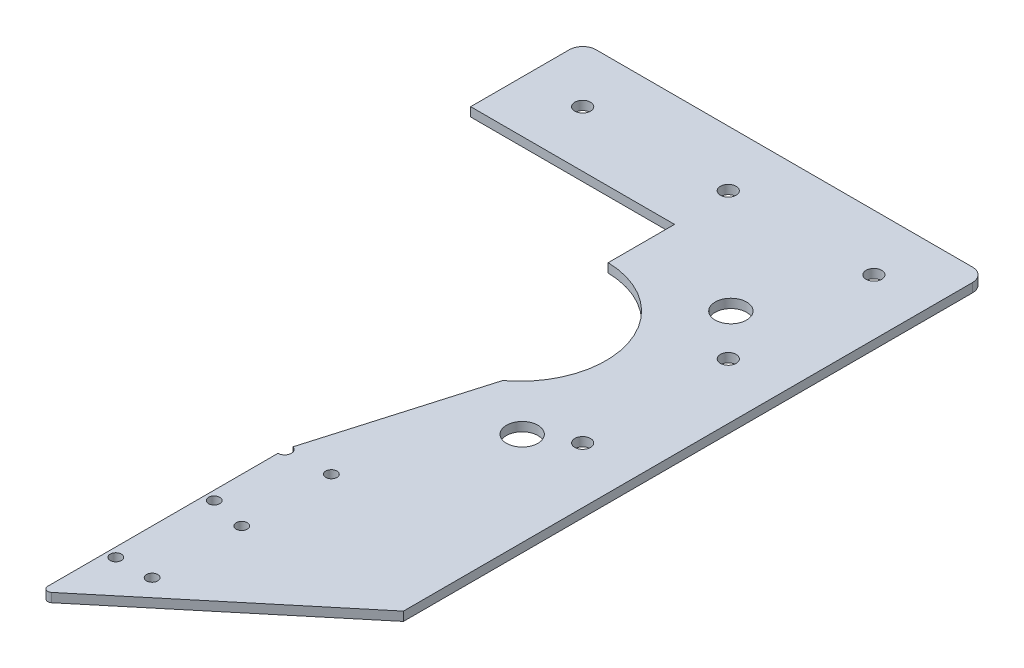
ISO-10303-21;
HEADER;
FILE_DESCRIPTION(('STEP AP214'),'2;1');
FILE_NAME('part.step','',(''),(''),'','','');
FILE_SCHEMA(('AUTOMOTIVE_DESIGN { 1 0 10303 214 1 1 1 1 }'));
ENDSEC;
DATA;
#1=APPLICATION_CONTEXT('core data for automotive mechanical design processes');
#2=APPLICATION_PROTOCOL_DEFINITION('international standard','automotive_design',2000,#1);
#3=PRODUCT_CONTEXT('',#1,'mechanical');
#4=PRODUCT('Part','Part','',(#3));
#5=PRODUCT_RELATED_PRODUCT_CATEGORY('part','',(#4));
#6=PRODUCT_DEFINITION_FORMATION('','',#4);
#7=PRODUCT_DEFINITION_CONTEXT('part definition',#1,'design');
#8=PRODUCT_DEFINITION('design','',#6,#7);
#9=PRODUCT_DEFINITION_SHAPE('','',#8);
#10=(LENGTH_UNIT() NAMED_UNIT(*) SI_UNIT(.MILLI.,.METRE.));
#11=(NAMED_UNIT(*) PLANE_ANGLE_UNIT() SI_UNIT($,.RADIAN.));
#12=(NAMED_UNIT(*) SI_UNIT($,.STERADIAN.) SOLID_ANGLE_UNIT());
#13=UNCERTAINTY_MEASURE_WITH_UNIT(LENGTH_MEASURE(1.E-05),#10,'distance_accuracy_value','');
#14=(GEOMETRIC_REPRESENTATION_CONTEXT(3) GLOBAL_UNCERTAINTY_ASSIGNED_CONTEXT((#13)) GLOBAL_UNIT_ASSIGNED_CONTEXT((#10,
#11,#12)) REPRESENTATION_CONTEXT('',''));
#15=CARTESIAN_POINT('',(0.,0.,0.));
#16=DIRECTION('',(0.,0.,1.));
#17=DIRECTION('',(1.,0.,0.));
#18=AXIS2_PLACEMENT_3D('',#15,#16,#17);
#19=CARTESIAN_POINT('',(-11.5454283324964,2.,55.8050847457628));
#20=DIRECTION('',(1.,0.,0.));
#21=DIRECTION('',(0.,0.,-1.));
#22=AXIS2_PLACEMENT_3D('',#19,#20,#21);
#23=PLANE('',#22);
#24=DIRECTION('',(0.,0.,1.));
#25=VECTOR('',#24,1.);
#26=CARTESIAN_POINT('',(-11.5454283324964,0.,55.8050847457628));
#27=LINE('',#26,#25);
#28=CARTESIAN_POINT('',(-11.5454283324964,0.,-9.19491525423725));
#29=VERTEX_POINT('',#28);
#30=CARTESIAN_POINT('',(-11.5454283324964,0.,5.61159626659359));
#31=VERTEX_POINT('',#30);
#32=EDGE_CURVE('E153',#29,#31,#27,.T.);
#33=ORIENTED_EDGE('',*,*,#32,.T.);
#34=DIRECTION('',(0.,1.,0.));
#35=VECTOR('',#34,1.);
#36=CARTESIAN_POINT('',(-11.5454283324964,0.,5.61159626659359));
#37=LINE('',#36,#35);
#38=CARTESIAN_POINT('',(-11.5454283324964,2.,5.61159626659359));
#39=VERTEX_POINT('',#38);
#40=EDGE_CURVE('E178',#31,#39,#37,.T.);
#41=ORIENTED_EDGE('',*,*,#40,.T.);
#42=DIRECTION('',(0.,0.,1.));
#43=VECTOR('',#42,1.);
#44=CARTESIAN_POINT('',(-11.5454283324964,2.,55.8050847457628));
#45=LINE('',#44,#43);
#46=CARTESIAN_POINT('',(-11.5454283324964,2.,-9.19491525423725));
#47=VERTEX_POINT('',#46);
#48=EDGE_CURVE('E266',#47,#39,#45,.T.);
#49=ORIENTED_EDGE('',*,*,#48,.F.);
#50=DIRECTION('',(0.,1.,0.));
#51=VECTOR('',#50,1.);
#52=CARTESIAN_POINT('',(-11.5454283324964,-71.175838597097,-9.19491525423725));
#53=LINE('',#52,#51);
#54=EDGE_CURVE('E211',#29,#47,#53,.T.);
#55=ORIENTED_EDGE('',*,*,#54,.F.);
#56=EDGE_LOOP('',(#33,#41,#49,#55));
#57=FACE_BOUND('',#56,.T.);
#58=ADVANCED_FACE('F40',(#57),#23,.F.);
#59=CARTESIAN_POINT('',(-57.0454283324964,2.,-9.19491525423725));
#60=DIRECTION('',(0.,0.,-1.));
#61=DIRECTION('',(-1.,0.,0.));
#62=AXIS2_PLACEMENT_3D('',#59,#60,#61);
#63=PLANE('',#62);
#64=ORIENTED_EDGE('',*,*,#54,.T.);
#65=DIRECTION('',(1.,0.,0.));
#66=VECTOR('',#65,1.);
#67=CARTESIAN_POINT('',(-57.0454283324964,2.,-9.19491525423725));
#68=LINE('',#67,#66);
#69=CARTESIAN_POINT('',(-57.0454283324964,2.,-9.19491525423725));
#70=VERTEX_POINT('',#69);
#71=EDGE_CURVE('E258',#70,#47,#68,.T.);
#72=ORIENTED_EDGE('',*,*,#71,.F.);
#73=DIRECTION('',(0.,-1.,0.));
#74=VECTOR('',#73,1.);
#75=CARTESIAN_POINT('',(-57.0454283324964,2.,-9.19491525423725));
#76=LINE('',#75,#74);
#77=CARTESIAN_POINT('',(-57.0454283324964,0.,-9.19491525423725));
#78=VERTEX_POINT('',#77);
#79=EDGE_CURVE('E174',#70,#78,#76,.T.);
#80=ORIENTED_EDGE('',*,*,#79,.T.);
#81=DIRECTION('',(1.,0.,0.));
#82=VECTOR('',#81,1.);
#83=CARTESIAN_POINT('',(-57.0454283324964,0.,-9.19491525423725));
#84=LINE('',#83,#82);
#85=EDGE_CURVE('E154',#78,#29,#84,.T.);
#86=ORIENTED_EDGE('',*,*,#85,.T.);
#87=EDGE_LOOP('',(#64,#72,#80,#86));
#88=FACE_BOUND('',#87,.T.);
#89=ADVANCED_FACE('F300',(#88),#63,.F.);
#90=CARTESIAN_POINT('',(0.,2.,0.));
#91=DIRECTION('',(0.,1.,0.));
#92=DIRECTION('',(0.,0.,1.));
#93=AXIS2_PLACEMENT_3D('',#90,#91,#92);
#94=PLANE('',#93);
#95=CARTESIAN_POINT('',(-1.54542833249639,2.,97.398618321744));
#96=DIRECTION('',(0.,1.,0.));
#97=DIRECTION('',(0.,0.,1.));
#98=AXIS2_PLACEMENT_3D('',#95,#96,#97);
#99=CIRCLE('',#98,1.25);
#100=CARTESIAN_POINT('',(-1.54542833249639,2.,98.648618321744));
#101=VERTEX_POINT('',#100);
#102=EDGE_CURVE('E563',#101,#101,#99,.T.);
#103=ORIENTED_EDGE('',*,*,#102,.F.);
#104=EDGE_LOOP('',(#103));
#105=FACE_BOUND('',#104,.T.);
#106=CARTESIAN_POINT('',(-1.54542833249639,2.,77.398618321744));
#107=DIRECTION('',(0.,1.,0.));
#108=DIRECTION('',(0.,0.,1.));
#109=AXIS2_PLACEMENT_3D('',#106,#107,#108);
#110=CIRCLE('',#109,1.25);
#111=CARTESIAN_POINT('',(-1.54542833249639,2.,78.648618321744));
#112=VERTEX_POINT('',#111);
#113=EDGE_CURVE('E566',#112,#112,#110,.T.);
#114=ORIENTED_EDGE('',*,*,#113,.F.);
#115=EDGE_LOOP('',(#114));
#116=FACE_BOUND('',#115,.T.);
#117=CARTESIAN_POINT('',(-1.54542833249639,2.,117.398618321744));
#118=DIRECTION('',(0.,1.,0.));
#119=DIRECTION('',(0.,0.,1.));
#120=AXIS2_PLACEMENT_3D('',#117,#118,#119);
#121=CIRCLE('',#120,1.25);
#122=CARTESIAN_POINT('',(-1.54542833249639,2.,118.648618321744));
#123=VERTEX_POINT('',#122);
#124=EDGE_CURVE('E582',#123,#123,#121,.T.);
#125=ORIENTED_EDGE('',*,*,#124,.F.);
#126=EDGE_LOOP('',(#125));
#127=FACE_BOUND('',#126,.T.);
#128=CARTESIAN_POINT('',(-9.54492595992691,2.,117.508337258848));
#129=DIRECTION('',(0.,1.,0.));
#130=DIRECTION('',(0.,0.,1.));
#131=AXIS2_PLACEMENT_3D('',#128,#129,#130);
#132=CIRCLE('',#131,1.25);
#133=CARTESIAN_POINT('',(-9.54492595992691,2.,118.758337258848));
#134=VERTEX_POINT('',#133);
#135=EDGE_CURVE('E589',#134,#134,#132,.T.);
#136=ORIENTED_EDGE('',*,*,#135,.F.);
#137=EDGE_LOOP('',(#136));
#138=FACE_BOUND('',#137,.T.);
#139=CARTESIAN_POINT('',(-9.54492595992691,2.,95.5512256416138));
#140=DIRECTION('',(0.,1.,0.));
#141=DIRECTION('',(0.,0.,1.));
#142=AXIS2_PLACEMENT_3D('',#139,#140,#141);
#143=CIRCLE('',#142,1.25);
#144=CARTESIAN_POINT('',(-9.54492595992691,2.,96.8012256416138));
#145=VERTEX_POINT('',#144);
#146=EDGE_CURVE('E144',#145,#145,#143,.T.);
#147=ORIENTED_EDGE('',*,*,#146,.F.);
#148=EDGE_LOOP('',(#147));
#149=FACE_BOUND('',#148,.T.);
#150=CARTESIAN_POINT('',(-11.5454283324964,2.,79.3092614399867));
#151=VERTEX_POINT('',#150);
#152=CARTESIAN_POINT('',(-11.5454283324964,2.,130.673113843783));
#153=VERTEX_POINT('',#152);
#154=EDGE_CURVE('E148',#151,#153,#45,.T.);
#155=ORIENTED_EDGE('',*,*,#154,.T.);
#156=CARTESIAN_POINT('',(-10.5454283324964,2.,130.673113843783));
#157=DIRECTION('',(0.,1.,0.));
#158=DIRECTION('',(0.,0.,1.));
#159=AXIS2_PLACEMENT_3D('',#156,#157,#158);
#160=CIRCLE('',#159,1.);
#161=CARTESIAN_POINT('',(-9.90609412629823,2.,131.442042821508));
#162=VERTEX_POINT('',#161);
#163=EDGE_CURVE('E12',#153,#162,#160,.T.);
#164=ORIENTED_EDGE('',*,*,#163,.T.);
#165=DIRECTION('',(0.76892897772483,0.,-0.639334206198173));
#166=VECTOR('',#165,1.);
#167=CARTESIAN_POINT('',(-11.5454283324964,2.,132.805084745763));
#168=LINE('',#167,#166);
#169=CARTESIAN_POINT('',(32.9545716675036,2.,95.8050847457628));
#170=VERTEX_POINT('',#169);
#171=EDGE_CURVE('E270',#162,#170,#168,.T.);
#172=ORIENTED_EDGE('',*,*,#171,.T.);
#173=DIRECTION('',(0.,0.,-1.));
#174=VECTOR('',#173,1.);
#175=CARTESIAN_POINT('',(32.9545716675036,2.,-34.1949152542373));
#176=LINE('',#175,#174);
#177=CARTESIAN_POINT('',(32.9545716675036,2.,-31.1949152542372));
#178=VERTEX_POINT('',#177);
#179=EDGE_CURVE('E282',#170,#178,#176,.T.);
#180=ORIENTED_EDGE('',*,*,#179,.T.);
#181=CARTESIAN_POINT('',(29.9545716675036,2.,-31.1949152542372));
#182=DIRECTION('',(0.,1.,0.));
#183=DIRECTION('',(0.,0.,1.));
#184=AXIS2_PLACEMENT_3D('',#181,#182,#183);
#185=CIRCLE('',#184,3.);
#186=CARTESIAN_POINT('',(29.9545716675035,2.,-34.1949152542373));
#187=VERTEX_POINT('',#186);
#188=EDGE_CURVE('E320',#178,#187,#185,.T.);
#189=ORIENTED_EDGE('',*,*,#188,.T.);
#190=DIRECTION('',(-1.,0.,0.));
#191=VECTOR('',#190,1.);
#192=CARTESIAN_POINT('',(-57.0454283324964,2.,-34.1949152542373));
#193=LINE('',#192,#191);
#194=CARTESIAN_POINT('',(-54.0454283324964,2.,-34.1949152542373));
#195=VERTEX_POINT('',#194);
#196=EDGE_CURVE('E175',#187,#195,#193,.T.);
#197=ORIENTED_EDGE('',*,*,#196,.T.);
#198=CARTESIAN_POINT('',(-54.0454283324964,2.,-31.1949152542372));
#199=DIRECTION('',(0.,1.,0.));
#200=DIRECTION('',(0.,0.,1.));
#201=AXIS2_PLACEMENT_3D('',#198,#199,#200);
#202=CIRCLE('',#201,3.);
#203=CARTESIAN_POINT('',(-57.0454283324964,2.,-31.1949152542372));
#204=VERTEX_POINT('',#203);
#205=EDGE_CURVE('E318',#195,#204,#202,.T.);
#206=ORIENTED_EDGE('',*,*,#205,.T.);
#207=DIRECTION('',(0.,0.,1.));
#208=VECTOR('',#207,1.);
#209=CARTESIAN_POINT('',(-57.0454283324964,2.,-34.1949152542373));
#210=LINE('',#209,#208);
#211=EDGE_CURVE('E170',#204,#70,#210,.T.);
#212=ORIENTED_EDGE('',*,*,#211,.T.);
#213=ORIENTED_EDGE('',*,*,#71,.T.);
#214=ORIENTED_EDGE('',*,*,#48,.T.);
#215=CARTESIAN_POINT('',(-12.0454283324964,2.,24.8050847457628));
#216=DIRECTION('',(0.,1.,0.));
#217=DIRECTION('',(0.,0.,1.));
#218=AXIS2_PLACEMENT_3D('',#215,#216,#217);
#219=CIRCLE('',#218,19.2);
#220=CARTESIAN_POINT('',(-0.545428332496404,2.,40.1800644205461));
#221=VERTEX_POINT('',#220);
#222=EDGE_CURVE('E203',#221,#39,#219,.T.);
#223=ORIENTED_EDGE('',*,*,#222,.F.);
#224=DIRECTION('',(0.280583353559269,0.,-0.959829662859736));
#225=VECTOR('',#224,1.);
#226=CARTESIAN_POINT('',(-0.545428332496404,2.,40.1800644205461));
#227=LINE('',#226,#225);
#228=CARTESIAN_POINT('',(-11.1245533021575,2.,76.3695169456971));
#229=VERTEX_POINT('',#228);
#230=EDGE_CURVE('E182',#229,#221,#227,.T.);
#231=ORIENTED_EDGE('',*,*,#230,.F.);
#232=CARTESIAN_POINT('',(-11.5454283324964,2.,77.8092614399867));
#233=DIRECTION('',(0.,1.,0.));
#234=DIRECTION('',(0.,0.,1.));
#235=AXIS2_PLACEMENT_3D('',#232,#233,#234);
#236=CIRCLE('',#235,1.5);
#237=EDGE_CURVE('E143',#151,#229,#236,.T.);
#238=ORIENTED_EDGE('',*,*,#237,.F.);
#239=EDGE_LOOP('',(#155,#164,#172,#180,#189,#197,#206,#212,#213,#214,#223,#231,#238));
#240=FACE_BOUND('',#239,.T.);
#241=CARTESIAN_POINT('',(20.4545716675036,2.,-21.6949152542372));
#242=DIRECTION('',(0.,1.,0.));
#243=DIRECTION('',(0.,0.,1.));
#244=AXIS2_PLACEMENT_3D('',#241,#242,#243);
#245=CIRCLE('',#244,1.74999999999999);
#246=CARTESIAN_POINT('',(20.4545716675036,2.,-19.9449152542373));
#247=VERTEX_POINT('',#246);
#248=EDGE_CURVE('E231',#247,#247,#245,.T.);
#249=ORIENTED_EDGE('',*,*,#248,.F.);
#250=EDGE_LOOP('',(#249));
#251=FACE_BOUND('',#250,.T.);
#252=CARTESIAN_POINT('',(-12.0454283324964,2.,-21.6949152542372));
#253=DIRECTION('',(0.,1.,0.));
#254=DIRECTION('',(0.,0.,1.));
#255=AXIS2_PLACEMENT_3D('',#252,#253,#254);
#256=CIRCLE('',#255,1.75);
#257=CARTESIAN_POINT('',(-12.0454283324964,2.,-19.9449152542372));
#258=VERTEX_POINT('',#257);
#259=EDGE_CURVE('E244',#258,#258,#256,.T.);
#260=ORIENTED_EDGE('',*,*,#259,.F.);
#261=EDGE_LOOP('',(#260));
#262=FACE_BOUND('',#261,.T.);
#263=CARTESIAN_POINT('',(-44.5454283324964,2.,-21.6949152542373));
#264=DIRECTION('',(0.,1.,0.));
#265=DIRECTION('',(0.,0.,1.));
#266=AXIS2_PLACEMENT_3D('',#263,#264,#265);
#267=CIRCLE('',#266,1.75);
#268=CARTESIAN_POINT('',(-44.5454283324964,2.,-19.9449152542372));
#269=VERTEX_POINT('',#268);
#270=EDGE_CURVE('E250',#269,#269,#267,.T.);
#271=ORIENTED_EDGE('',*,*,#270,.F.);
#272=EDGE_LOOP('',(#271));
#273=FACE_BOUND('',#272,.T.);
#274=CARTESIAN_POINT('',(20.4545716675036,2.,10.8050847457628));
#275=DIRECTION('',(0.,1.,0.));
#276=DIRECTION('',(0.,0.,1.));
#277=AXIS2_PLACEMENT_3D('',#274,#275,#276);
#278=CIRCLE('',#277,1.75);
#279=CARTESIAN_POINT('',(20.4545716675036,2.,12.5550847457628));
#280=VERTEX_POINT('',#279);
#281=EDGE_CURVE('E237',#280,#280,#278,.T.);
#282=ORIENTED_EDGE('',*,*,#281,.F.);
#283=EDGE_LOOP('',(#282));
#284=FACE_BOUND('',#283,.T.);
#285=CARTESIAN_POINT('',(20.4545716675036,2.,43.3050847457627));
#286=DIRECTION('',(0.,1.,0.));
#287=DIRECTION('',(0.,0.,1.));
#288=AXIS2_PLACEMENT_3D('',#285,#286,#287);
#289=CIRCLE('',#288,1.75);
#290=CARTESIAN_POINT('',(20.4545716675036,2.,45.0550847457628));
#291=VERTEX_POINT('',#290);
#292=EDGE_CURVE('E225',#291,#291,#289,.T.);
#293=ORIENTED_EDGE('',*,*,#292,.F.);
#294=EDGE_LOOP('',(#293));
#295=FACE_BOUND('',#294,.T.);
#296=CARTESIAN_POINT('',(11.4931539006409,2.,1.26650251262484));
#297=DIRECTION('',(0.,1.,0.));
#298=DIRECTION('',(0.,0.,1.));
#299=AXIS2_PLACEMENT_3D('',#296,#297,#298);
#300=CIRCLE('',#299,3.5);
#301=CARTESIAN_POINT('',(11.4931539006409,2.,4.76650251262484));
#302=VERTEX_POINT('',#301);
#303=EDGE_CURVE('E206',#302,#302,#300,.T.);
#304=ORIENTED_EDGE('',*,*,#303,.F.);
#305=EDGE_LOOP('',(#304));
#306=FACE_BOUND('',#305,.T.);
#307=CARTESIAN_POINT('',(12.0271004853378,2.,48.3750847457627));
#308=DIRECTION('',(0.,1.,0.));
#309=DIRECTION('',(0.,0.,1.));
#310=AXIS2_PLACEMENT_3D('',#307,#308,#309);
#311=CIRCLE('',#310,3.5);
#312=CARTESIAN_POINT('',(12.0271004853378,2.,51.8750847457627));
#313=VERTEX_POINT('',#312);
#314=EDGE_CURVE('E217',#313,#313,#311,.T.);
#315=ORIENTED_EDGE('',*,*,#314,.F.);
#316=EDGE_LOOP('',(#315));
#317=FACE_BOUND('',#316,.T.);
#318=ADVANCED_FACE('F304',(#105,#116,#127,#138,#149,#240,#251,#262,#273,#284,#295,#306,#317),
#94,.T.);
#319=CARTESIAN_POINT('',(0.,0.,0.));
#320=DIRECTION('',(0.,1.,0.));
#321=DIRECTION('',(0.,0.,1.));
#322=AXIS2_PLACEMENT_3D('',#319,#320,#321);
#323=PLANE('',#322);
#324=CARTESIAN_POINT('',(-1.54542833249639,0.,97.398618321744));
#325=DIRECTION('',(0.,1.,0.));
#326=DIRECTION('',(0.,0.,-1.));
#327=AXIS2_PLACEMENT_3D('',#324,#325,#326);
#328=CIRCLE('',#327,1.25);
#329=CARTESIAN_POINT('',(-1.54542833249639,0.,96.148618321744));
#330=VERTEX_POINT('',#329);
#331=EDGE_CURVE('E565',#330,#330,#328,.T.);
#332=ORIENTED_EDGE('',*,*,#331,.T.);
#333=EDGE_LOOP('',(#332));
#334=FACE_BOUND('',#333,.T.);
#335=CARTESIAN_POINT('',(-1.54542833249639,0.,77.398618321744));
#336=DIRECTION('',(0.,1.,0.));
#337=DIRECTION('',(0.,0.,-1.));
#338=AXIS2_PLACEMENT_3D('',#335,#336,#337);
#339=CIRCLE('',#338,1.25);
#340=CARTESIAN_POINT('',(-1.54542833249639,0.,76.148618321744));
#341=VERTEX_POINT('',#340);
#342=EDGE_CURVE('E567',#341,#341,#339,.T.);
#343=ORIENTED_EDGE('',*,*,#342,.T.);
#344=EDGE_LOOP('',(#343));
#345=FACE_BOUND('',#344,.T.);
#346=CARTESIAN_POINT('',(-1.54542833249639,0.,117.398618321744));
#347=DIRECTION('',(0.,1.,0.));
#348=DIRECTION('',(0.,0.,-1.));
#349=AXIS2_PLACEMENT_3D('',#346,#347,#348);
#350=CIRCLE('',#349,1.25);
#351=CARTESIAN_POINT('',(-1.54542833249639,0.,116.148618321744));
#352=VERTEX_POINT('',#351);
#353=EDGE_CURVE('E587',#352,#352,#350,.T.);
#354=ORIENTED_EDGE('',*,*,#353,.T.);
#355=EDGE_LOOP('',(#354));
#356=FACE_BOUND('',#355,.T.);
#357=CARTESIAN_POINT('',(-9.54492595992691,0.,117.508337258848));
#358=DIRECTION('',(0.,1.,0.));
#359=DIRECTION('',(0.,0.,1.));
#360=AXIS2_PLACEMENT_3D('',#357,#358,#359);
#361=CIRCLE('',#360,1.25);
#362=CARTESIAN_POINT('',(-9.54492595992691,0.,118.758337258848));
#363=VERTEX_POINT('',#362);
#364=EDGE_CURVE('E586',#363,#363,#361,.T.);
#365=ORIENTED_EDGE('',*,*,#364,.T.);
#366=EDGE_LOOP('',(#365));
#367=FACE_BOUND('',#366,.T.);
#368=CARTESIAN_POINT('',(-9.54492595992691,0.,95.5512256416138));
#369=DIRECTION('',(0.,1.,0.));
#370=DIRECTION('',(0.,0.,1.));
#371=AXIS2_PLACEMENT_3D('',#368,#369,#370);
#372=CIRCLE('',#371,1.25);
#373=CARTESIAN_POINT('',(-9.54492595992691,0.,96.8012256416138));
#374=VERTEX_POINT('',#373);
#375=EDGE_CURVE('E593',#374,#374,#372,.T.);
#376=ORIENTED_EDGE('',*,*,#375,.T.);
#377=EDGE_LOOP('',(#376));
#378=FACE_BOUND('',#377,.T.);
#379=DIRECTION('',(0.76892897772483,0.,-0.639334206198173));
#380=VECTOR('',#379,1.);
#381=CARTESIAN_POINT('',(-11.5454283324964,0.,132.805084745763));
#382=LINE('',#381,#380);
#383=CARTESIAN_POINT('',(-9.90609412629823,0.,131.442042821508));
#384=VERTEX_POINT('',#383);
#385=CARTESIAN_POINT('',(32.9545716675036,0.,95.8050847457628));
#386=VERTEX_POINT('',#385);
#387=EDGE_CURVE('E157',#384,#386,#382,.T.);
#388=ORIENTED_EDGE('',*,*,#387,.F.);
#389=CARTESIAN_POINT('',(-10.5454283324964,0.,130.673113843783));
#390=DIRECTION('',(0.,1.,0.));
#391=DIRECTION('',(0.,0.,1.));
#392=AXIS2_PLACEMENT_3D('',#389,#390,#391);
#393=CIRCLE('',#392,1.);
#394=CARTESIAN_POINT('',(-11.5454283324964,0.,130.673113843783));
#395=VERTEX_POINT('',#394);
#396=EDGE_CURVE('E63',#384,#395,#393,.F.);
#397=ORIENTED_EDGE('',*,*,#396,.T.);
#398=CARTESIAN_POINT('',(-11.5454283324964,0.,79.3092614399867));
#399=VERTEX_POINT('',#398);
#400=EDGE_CURVE('E147',#399,#395,#27,.T.);
#401=ORIENTED_EDGE('',*,*,#400,.F.);
#402=CARTESIAN_POINT('',(-11.5454283324964,0.,77.8092614399867));
#403=DIRECTION('',(0.,1.,0.));
#404=DIRECTION('',(0.,0.,1.));
#405=AXIS2_PLACEMENT_3D('',#402,#403,#404);
#406=CIRCLE('',#405,1.5);
#407=CARTESIAN_POINT('',(-11.1245533021575,0.,76.3695169456971));
#408=VERTEX_POINT('',#407);
#409=EDGE_CURVE('E135',#399,#408,#406,.T.);
#410=ORIENTED_EDGE('',*,*,#409,.T.);
#411=DIRECTION('',(0.280583353559269,0.,-0.959829662859736));
#412=VECTOR('',#411,1.);
#413=CARTESIAN_POINT('',(-0.545428332496404,0.,40.1800644205461));
#414=LINE('',#413,#412);
#415=CARTESIAN_POINT('',(-0.545428332496404,0.,40.1800644205461));
#416=VERTEX_POINT('',#415);
#417=EDGE_CURVE('E149',#408,#416,#414,.T.);
#418=ORIENTED_EDGE('',*,*,#417,.T.);
#419=CARTESIAN_POINT('',(-12.0454283324964,0.,24.8050847457628));
#420=DIRECTION('',(0.,1.,0.));
#421=DIRECTION('',(0.,0.,1.));
#422=AXIS2_PLACEMENT_3D('',#419,#420,#421);
#423=CIRCLE('',#422,19.2);
#424=EDGE_CURVE('E185',#416,#31,#423,.T.);
#425=ORIENTED_EDGE('',*,*,#424,.T.);
#426=ORIENTED_EDGE('',*,*,#32,.F.);
#427=ORIENTED_EDGE('',*,*,#85,.F.);
#428=DIRECTION('',(0.,0.,1.));
#429=VECTOR('',#428,1.);
#430=CARTESIAN_POINT('',(-57.0454283324964,0.,-34.1949152542373));
#431=LINE('',#430,#429);
#432=CARTESIAN_POINT('',(-57.0454283324964,0.,-31.1949152542372));
#433=VERTEX_POINT('',#432);
#434=EDGE_CURVE('E159',#433,#78,#431,.T.);
#435=ORIENTED_EDGE('',*,*,#434,.F.);
#436=CARTESIAN_POINT('',(-54.0454283324964,0.,-31.1949152542372));
#437=DIRECTION('',(0.,1.,0.));
#438=DIRECTION('',(0.,0.,1.));
#439=AXIS2_PLACEMENT_3D('',#436,#437,#438);
#440=CIRCLE('',#439,3.);
#441=CARTESIAN_POINT('',(-54.0454283324964,0.,-34.1949152542373));
#442=VERTEX_POINT('',#441);
#443=EDGE_CURVE('E328',#433,#442,#440,.F.);
#444=ORIENTED_EDGE('',*,*,#443,.T.);
#445=DIRECTION('',(-1.,0.,0.));
#446=VECTOR('',#445,1.);
#447=CARTESIAN_POINT('',(-57.0454283324964,0.,-34.1949152542373));
#448=LINE('',#447,#446);
#449=CARTESIAN_POINT('',(29.9545716675035,0.,-34.1949152542373));
#450=VERTEX_POINT('',#449);
#451=EDGE_CURVE('E167',#450,#442,#448,.T.);
#452=ORIENTED_EDGE('',*,*,#451,.F.);
#453=CARTESIAN_POINT('',(29.9545716675036,0.,-31.1949152542372));
#454=DIRECTION('',(0.,1.,0.));
#455=DIRECTION('',(0.,0.,1.));
#456=AXIS2_PLACEMENT_3D('',#453,#454,#455);
#457=CIRCLE('',#456,3.);
#458=CARTESIAN_POINT('',(32.9545716675036,0.,-31.1949152542372));
#459=VERTEX_POINT('',#458);
#460=EDGE_CURVE('E329',#450,#459,#457,.F.);
#461=ORIENTED_EDGE('',*,*,#460,.T.);
#462=DIRECTION('',(0.,0.,-1.));
#463=VECTOR('',#462,1.);
#464=CARTESIAN_POINT('',(32.9545716675036,0.,-34.1949152542373));
#465=LINE('',#464,#463);
#466=EDGE_CURVE('E164',#386,#459,#465,.T.);
#467=ORIENTED_EDGE('',*,*,#466,.F.);
#468=EDGE_LOOP('',(#388,#397,#401,#410,#418,#425,#426,#427,#435,#444,#452,#461,#467));
#469=FACE_BOUND('',#468,.T.);
#470=CARTESIAN_POINT('',(-44.5454283324964,0.,-21.6949152542373));
#471=DIRECTION('',(0.,1.,0.));
#472=DIRECTION('',(0.,0.,1.));
#473=AXIS2_PLACEMENT_3D('',#470,#471,#472);
#474=CIRCLE('',#473,1.75);
#475=CARTESIAN_POINT('',(-44.5454283324964,0.,-19.9449152542372));
#476=VERTEX_POINT('',#475);
#477=EDGE_CURVE('E248',#476,#476,#474,.T.);
#478=ORIENTED_EDGE('',*,*,#477,.T.);
#479=EDGE_LOOP('',(#478));
#480=FACE_BOUND('',#479,.T.);
#481=CARTESIAN_POINT('',(-12.0454283324964,0.,-21.6949152542372));
#482=DIRECTION('',(0.,1.,0.));
#483=DIRECTION('',(0.,0.,1.));
#484=AXIS2_PLACEMENT_3D('',#481,#482,#483);
#485=CIRCLE('',#484,1.75);
#486=CARTESIAN_POINT('',(-12.0454283324964,0.,-19.9449152542372));
#487=VERTEX_POINT('',#486);
#488=EDGE_CURVE('E241',#487,#487,#485,.T.);
#489=ORIENTED_EDGE('',*,*,#488,.T.);
#490=EDGE_LOOP('',(#489));
#491=FACE_BOUND('',#490,.T.);
#492=CARTESIAN_POINT('',(20.4545716675036,0.,10.8050847457628));
#493=DIRECTION('',(0.,1.,0.));
#494=DIRECTION('',(0.,0.,1.));
#495=AXIS2_PLACEMENT_3D('',#492,#493,#494);
#496=CIRCLE('',#495,1.75);
#497=CARTESIAN_POINT('',(20.4545716675036,0.,12.5550847457628));
#498=VERTEX_POINT('',#497);
#499=EDGE_CURVE('E235',#498,#498,#496,.T.);
#500=ORIENTED_EDGE('',*,*,#499,.T.);
#501=EDGE_LOOP('',(#500));
#502=FACE_BOUND('',#501,.T.);
#503=CARTESIAN_POINT('',(20.4545716675036,0.,-21.6949152542372));
#504=DIRECTION('',(0.,1.,0.));
#505=DIRECTION('',(0.,0.,1.));
#506=AXIS2_PLACEMENT_3D('',#503,#504,#505);
#507=CIRCLE('',#506,1.74999999999999);
#508=CARTESIAN_POINT('',(20.4545716675036,0.,-19.9449152542373));
#509=VERTEX_POINT('',#508);
#510=EDGE_CURVE('E229',#509,#509,#507,.T.);
#511=ORIENTED_EDGE('',*,*,#510,.T.);
#512=EDGE_LOOP('',(#511));
#513=FACE_BOUND('',#512,.T.);
#514=CARTESIAN_POINT('',(20.4545716675036,0.,43.3050847457627));
#515=DIRECTION('',(0.,1.,0.));
#516=DIRECTION('',(0.,0.,1.));
#517=AXIS2_PLACEMENT_3D('',#514,#515,#516);
#518=CIRCLE('',#517,1.75);
#519=CARTESIAN_POINT('',(20.4545716675036,0.,45.0550847457628));
#520=VERTEX_POINT('',#519);
#521=EDGE_CURVE('E214',#520,#520,#518,.T.);
#522=ORIENTED_EDGE('',*,*,#521,.T.);
#523=EDGE_LOOP('',(#522));
#524=FACE_BOUND('',#523,.T.);
#525=CARTESIAN_POINT('',(11.4931539006409,0.,1.26650251262484));
#526=DIRECTION('',(0.,1.,0.));
#527=DIRECTION('',(0.,0.,1.));
#528=AXIS2_PLACEMENT_3D('',#525,#526,#527);
#529=CIRCLE('',#528,3.5);
#530=CARTESIAN_POINT('',(11.4931539006409,0.,4.76650251262484));
#531=VERTEX_POINT('',#530);
#532=EDGE_CURVE('E207',#531,#531,#529,.F.);
#533=ORIENTED_EDGE('',*,*,#532,.F.);
#534=EDGE_LOOP('',(#533));
#535=FACE_BOUND('',#534,.T.);
#536=CARTESIAN_POINT('',(12.0271004853378,0.,48.3750847457627));
#537=DIRECTION('',(0.,1.,0.));
#538=DIRECTION('',(0.,0.,1.));
#539=AXIS2_PLACEMENT_3D('',#536,#537,#538);
#540=CIRCLE('',#539,3.5);
#541=CARTESIAN_POINT('',(12.0271004853378,0.,51.8750847457627));
#542=VERTEX_POINT('',#541);
#543=EDGE_CURVE('E210',#542,#542,#540,.F.);
#544=ORIENTED_EDGE('',*,*,#543,.F.);
#545=EDGE_LOOP('',(#544));
#546=FACE_BOUND('',#545,.T.);
#547=ADVANCED_FACE('F151',(#334,#345,#356,#367,#378,#469,#480,#491,#502,#513,#524,#535,#546),
#323,.F.);
#548=CARTESIAN_POINT('',(-57.0454283324964,2.,-34.1949152542373));
#549=DIRECTION('',(1.,0.,0.));
#550=DIRECTION('',(0.,0.,-1.));
#551=AXIS2_PLACEMENT_3D('',#548,#549,#550);
#552=PLANE('',#551);
#553=ORIENTED_EDGE('',*,*,#211,.F.);
#554=DIRECTION('',(0.,-1.,0.));
#555=VECTOR('',#554,1.);
#556=CARTESIAN_POINT('',(-57.0454283324964,2.,-31.1949152542372));
#557=LINE('',#556,#555);
#558=EDGE_CURVE('E181',#204,#433,#557,.T.);
#559=ORIENTED_EDGE('',*,*,#558,.T.);
#560=ORIENTED_EDGE('',*,*,#434,.T.);
#561=ORIENTED_EDGE('',*,*,#79,.F.);
#562=EDGE_LOOP('',(#553,#559,#560,#561));
#563=FACE_BOUND('',#562,.T.);
#564=ADVANCED_FACE('F294',(#563),#552,.F.);
#565=ORIENTED_EDGE('',*,*,#400,.T.);
#566=DIRECTION('',(0.,-1.,0.));
#567=VECTOR('',#566,1.);
#568=CARTESIAN_POINT('',(-11.5454283324964,2.,130.673113843783));
#569=LINE('',#568,#567);
#570=EDGE_CURVE('E49',#395,#153,#569,.F.);
#571=ORIENTED_EDGE('',*,*,#570,.T.);
#572=ORIENTED_EDGE('',*,*,#154,.F.);
#573=DIRECTION('',(0.,1.,0.));
#574=VECTOR('',#573,1.);
#575=CARTESIAN_POINT('',(-11.5454283324964,0.,79.3092614399867));
#576=LINE('',#575,#574);
#577=EDGE_CURVE('E138',#151,#399,#576,.F.);
#578=ORIENTED_EDGE('',*,*,#577,.T.);
#579=EDGE_LOOP('',(#565,#571,#572,#578));
#580=FACE_BOUND('',#579,.T.);
#581=ADVANCED_FACE('F146',(#580),#23,.F.);
#582=CARTESIAN_POINT('',(-11.5454283324964,2.,132.805084745763));
#583=DIRECTION('',(-0.639334206198173,0.,-0.76892897772483));
#584=DIRECTION('',(-0.76892897772483,0.,0.639334206198173));
#585=AXIS2_PLACEMENT_3D('',#582,#583,#584);
#586=PLANE('',#585);
#587=ORIENTED_EDGE('',*,*,#171,.F.);
#588=DIRECTION('',(0.,-1.,0.));
#589=VECTOR('',#588,1.);
#590=CARTESIAN_POINT('',(-9.90609412629823,2.,131.442042821508));
#591=LINE('',#590,#589);
#592=EDGE_CURVE('E311',#162,#384,#591,.T.);
#593=ORIENTED_EDGE('',*,*,#592,.T.);
#594=ORIENTED_EDGE('',*,*,#387,.T.);
#595=DIRECTION('',(0.,-1.,0.));
#596=VECTOR('',#595,1.);
#597=CARTESIAN_POINT('',(32.9545716675036,2.,95.8050847457628));
#598=LINE('',#597,#596);
#599=EDGE_CURVE('E171',#170,#386,#598,.T.);
#600=ORIENTED_EDGE('',*,*,#599,.F.);
#601=EDGE_LOOP('',(#587,#593,#594,#600));
#602=FACE_BOUND('',#601,.T.);
#603=ADVANCED_FACE('F368',(#602),#586,.F.);
#604=CARTESIAN_POINT('',(32.9545716675036,2.,-34.1949152542373));
#605=DIRECTION('',(-1.,0.,0.));
#606=DIRECTION('',(0.,0.,1.));
#607=AXIS2_PLACEMENT_3D('',#604,#605,#606);
#608=PLANE('',#607);
#609=ORIENTED_EDGE('',*,*,#466,.T.);
#610=DIRECTION('',(0.,-1.,0.));
#611=VECTOR('',#610,1.);
#612=CARTESIAN_POINT('',(32.9545716675036,2.,-31.1949152542372));
#613=LINE('',#612,#611);
#614=EDGE_CURVE('E315',#459,#178,#613,.F.);
#615=ORIENTED_EDGE('',*,*,#614,.T.);
#616=ORIENTED_EDGE('',*,*,#179,.F.);
#617=ORIENTED_EDGE('',*,*,#599,.T.);
#618=EDGE_LOOP('',(#609,#615,#616,#617));
#619=FACE_BOUND('',#618,.T.);
#620=ADVANCED_FACE('F336',(#619),#608,.F.);
#621=CARTESIAN_POINT('',(-57.0454283324964,2.,-34.1949152542373));
#622=DIRECTION('',(0.,0.,1.));
#623=DIRECTION('',(1.,0.,0.));
#624=AXIS2_PLACEMENT_3D('',#621,#622,#623);
#625=PLANE('',#624);
#626=ORIENTED_EDGE('',*,*,#451,.T.);
#627=DIRECTION('',(0.,-1.,0.));
#628=VECTOR('',#627,1.);
#629=CARTESIAN_POINT('',(-54.0454283324964,2.,-34.1949152542373));
#630=LINE('',#629,#628);
#631=EDGE_CURVE('E323',#442,#195,#630,.F.);
#632=ORIENTED_EDGE('',*,*,#631,.T.);
#633=ORIENTED_EDGE('',*,*,#196,.F.);
#634=DIRECTION('',(0.,-1.,0.));
#635=VECTOR('',#634,1.);
#636=CARTESIAN_POINT('',(29.9545716675036,2.,-34.1949152542373));
#637=LINE('',#636,#635);
#638=EDGE_CURVE('E325',#187,#450,#637,.T.);
#639=ORIENTED_EDGE('',*,*,#638,.T.);
#640=EDGE_LOOP('',(#626,#632,#633,#639));
#641=FACE_BOUND('',#640,.T.);
#642=ADVANCED_FACE('F344',(#641),#625,.F.);
#643=CARTESIAN_POINT('',(-44.5454283324964,2.,-21.6949152542373));
#644=DIRECTION('',(0.,-1.,0.));
#645=DIRECTION('',(0.,0.,-1.));
#646=AXIS2_PLACEMENT_3D('',#643,#644,#645);
#647=CYLINDRICAL_SURFACE('',#646,1.75);
#648=ORIENTED_EDGE('',*,*,#270,.T.);
#649=EDGE_LOOP('',(#648));
#650=FACE_BOUND('',#649,.T.);
#651=ORIENTED_EDGE('',*,*,#477,.F.);
#652=EDGE_LOOP('',(#651));
#653=FACE_BOUND('',#652,.T.);
#654=ADVANCED_FACE('F389',(#650,#653),#647,.F.);
#655=CARTESIAN_POINT('',(-12.0454283324964,2.,-21.6949152542372));
#656=DIRECTION('',(0.,-1.,0.));
#657=DIRECTION('',(0.,0.,-1.));
#658=AXIS2_PLACEMENT_3D('',#655,#656,#657);
#659=CYLINDRICAL_SURFACE('',#658,1.75);
#660=ORIENTED_EDGE('',*,*,#259,.T.);
#661=EDGE_LOOP('',(#660));
#662=FACE_BOUND('',#661,.T.);
#663=ORIENTED_EDGE('',*,*,#488,.F.);
#664=EDGE_LOOP('',(#663));
#665=FACE_BOUND('',#664,.T.);
#666=ADVANCED_FACE('F405',(#662,#665),#659,.F.);
#667=CARTESIAN_POINT('',(20.4545716675036,2.,10.8050847457628));
#668=DIRECTION('',(0.,-1.,0.));
#669=DIRECTION('',(0.,0.,-1.));
#670=AXIS2_PLACEMENT_3D('',#667,#668,#669);
#671=CYLINDRICAL_SURFACE('',#670,1.75);
#672=ORIENTED_EDGE('',*,*,#281,.T.);
#673=EDGE_LOOP('',(#672));
#674=FACE_BOUND('',#673,.T.);
#675=ORIENTED_EDGE('',*,*,#499,.F.);
#676=EDGE_LOOP('',(#675));
#677=FACE_BOUND('',#676,.T.);
#678=ADVANCED_FACE('F412',(#674,#677),#671,.F.);
#679=CARTESIAN_POINT('',(20.4545716675036,2.,-21.6949152542372));
#680=DIRECTION('',(0.,-1.,0.));
#681=DIRECTION('',(0.,0.,-1.));
#682=AXIS2_PLACEMENT_3D('',#679,#680,#681);
#683=CYLINDRICAL_SURFACE('',#682,1.74999999999999);
#684=ORIENTED_EDGE('',*,*,#248,.T.);
#685=EDGE_LOOP('',(#684));
#686=FACE_BOUND('',#685,.T.);
#687=ORIENTED_EDGE('',*,*,#510,.F.);
#688=EDGE_LOOP('',(#687));
#689=FACE_BOUND('',#688,.T.);
#690=ADVANCED_FACE('F420',(#686,#689),#683,.F.);
#691=CARTESIAN_POINT('',(20.4545716675036,2.,43.3050847457627));
#692=DIRECTION('',(0.,-1.,0.));
#693=DIRECTION('',(0.,0.,-1.));
#694=AXIS2_PLACEMENT_3D('',#691,#692,#693);
#695=CYLINDRICAL_SURFACE('',#694,1.75);
#696=ORIENTED_EDGE('',*,*,#292,.T.);
#697=EDGE_LOOP('',(#696));
#698=FACE_BOUND('',#697,.T.);
#699=ORIENTED_EDGE('',*,*,#521,.F.);
#700=EDGE_LOOP('',(#699));
#701=FACE_BOUND('',#700,.T.);
#702=ADVANCED_FACE('F428',(#698,#701),#695,.F.);
#703=CARTESIAN_POINT('',(12.0271004853378,-71.175838597097,48.3750847457627));
#704=DIRECTION('',(0.,1.,0.));
#705=DIRECTION('',(0.,0.,1.));
#706=AXIS2_PLACEMENT_3D('',#703,#704,#705);
#707=CYLINDRICAL_SURFACE('',#706,3.5);
#708=ORIENTED_EDGE('',*,*,#543,.T.);
#709=EDGE_LOOP('',(#708));
#710=FACE_BOUND('',#709,.T.);
#711=ORIENTED_EDGE('',*,*,#314,.T.);
#712=EDGE_LOOP('',(#711));
#713=FACE_BOUND('',#712,.T.);
#714=ADVANCED_FACE('F436',(#710,#713),#707,.F.);
#715=CARTESIAN_POINT('',(11.4931539006409,-71.175838597097,1.26650251262484));
#716=DIRECTION('',(0.,1.,0.));
#717=DIRECTION('',(0.,0.,1.));
#718=AXIS2_PLACEMENT_3D('',#715,#716,#717);
#719=CYLINDRICAL_SURFACE('',#718,3.5);
#720=ORIENTED_EDGE('',*,*,#532,.T.);
#721=EDGE_LOOP('',(#720));
#722=FACE_BOUND('',#721,.T.);
#723=ORIENTED_EDGE('',*,*,#303,.T.);
#724=EDGE_LOOP('',(#723));
#725=FACE_BOUND('',#724,.T.);
#726=ADVANCED_FACE('F445',(#722,#725),#719,.F.);
#727=CARTESIAN_POINT('',(-12.0454283324964,0.,24.8050847457628));
#728=DIRECTION('',(0.,1.,0.));
#729=DIRECTION('',(0.,0.,1.));
#730=AXIS2_PLACEMENT_3D('',#727,#728,#729);
#731=CYLINDRICAL_SURFACE('',#730,19.2);
#732=ORIENTED_EDGE('',*,*,#424,.F.);
#733=DIRECTION('',(0.,1.,0.));
#734=VECTOR('',#733,1.);
#735=CARTESIAN_POINT('',(-0.545428332496404,0.,40.1800644205461));
#736=LINE('',#735,#734);
#737=EDGE_CURVE('E186',#416,#221,#736,.T.);
#738=ORIENTED_EDGE('',*,*,#737,.T.);
#739=ORIENTED_EDGE('',*,*,#222,.T.);
#740=ORIENTED_EDGE('',*,*,#40,.F.);
#741=EDGE_LOOP('',(#732,#738,#739,#740));
#742=FACE_BOUND('',#741,.T.);
#743=ADVANCED_FACE('F355',(#742),#731,.F.);
#744=CARTESIAN_POINT('',(-0.545428332496404,0.,40.1800644205461));
#745=DIRECTION('',(0.959829662859736,0.,0.280583353559269));
#746=DIRECTION('',(0.280583353559269,0.,-0.959829662859736));
#747=AXIS2_PLACEMENT_3D('',#744,#745,#746);
#748=PLANE('',#747);
#749=ORIENTED_EDGE('',*,*,#417,.F.);
#750=DIRECTION('',(0.,1.,0.));
#751=VECTOR('',#750,1.);
#752=CARTESIAN_POINT('',(-11.1245533021575,0.,76.3695169456971));
#753=LINE('',#752,#751);
#754=EDGE_CURVE('E141',#408,#229,#753,.T.);
#755=ORIENTED_EDGE('',*,*,#754,.T.);
#756=ORIENTED_EDGE('',*,*,#230,.T.);
#757=ORIENTED_EDGE('',*,*,#737,.F.);
#758=EDGE_LOOP('',(#749,#755,#756,#757));
#759=FACE_BOUND('',#758,.T.);
#760=ADVANCED_FACE('F349',(#759),#748,.F.);
#761=CARTESIAN_POINT('',(-54.0454283324964,2.,-31.1949152542372));
#762=DIRECTION('',(0.,-1.,0.));
#763=DIRECTION('',(0.,0.,-1.));
#764=AXIS2_PLACEMENT_3D('',#761,#762,#763);
#765=CYLINDRICAL_SURFACE('',#764,3.);
#766=ORIENTED_EDGE('',*,*,#205,.F.);
#767=ORIENTED_EDGE('',*,*,#631,.F.);
#768=ORIENTED_EDGE('',*,*,#443,.F.);
#769=ORIENTED_EDGE('',*,*,#558,.F.);
#770=EDGE_LOOP('',(#766,#767,#768,#769));
#771=FACE_BOUND('',#770,.T.);
#772=ADVANCED_FACE('F347',(#771),#765,.T.);
#773=CARTESIAN_POINT('',(29.9545716675036,2.,-31.1949152542372));
#774=DIRECTION('',(0.,-1.,0.));
#775=DIRECTION('',(0.,0.,-1.));
#776=AXIS2_PLACEMENT_3D('',#773,#774,#775);
#777=CYLINDRICAL_SURFACE('',#776,3.);
#778=ORIENTED_EDGE('',*,*,#188,.F.);
#779=ORIENTED_EDGE('',*,*,#614,.F.);
#780=ORIENTED_EDGE('',*,*,#460,.F.);
#781=ORIENTED_EDGE('',*,*,#638,.F.);
#782=EDGE_LOOP('',(#778,#779,#780,#781));
#783=FACE_BOUND('',#782,.T.);
#784=ADVANCED_FACE('F340',(#783),#777,.T.);
#785=CARTESIAN_POINT('',(-11.5454283324964,0.,77.8092614399867));
#786=DIRECTION('',(0.,1.,0.));
#787=DIRECTION('',(0.,0.,1.));
#788=AXIS2_PLACEMENT_3D('',#785,#786,#787);
#789=CYLINDRICAL_SURFACE('',#788,1.5);
#790=ORIENTED_EDGE('',*,*,#237,.T.);
#791=ORIENTED_EDGE('',*,*,#754,.F.);
#792=ORIENTED_EDGE('',*,*,#409,.F.);
#793=ORIENTED_EDGE('',*,*,#577,.F.);
#794=EDGE_LOOP('',(#790,#791,#792,#793));
#795=FACE_BOUND('',#794,.T.);
#796=ADVANCED_FACE('F137',(#795),#789,.F.);
#797=CARTESIAN_POINT('',(-10.5454283324964,2.,130.673113843783));
#798=DIRECTION('',(0.,-1.,0.));
#799=DIRECTION('',(0.,0.,-1.));
#800=AXIS2_PLACEMENT_3D('',#797,#798,#799);
#801=CYLINDRICAL_SURFACE('',#800,1.);
#802=ORIENTED_EDGE('',*,*,#163,.F.);
#803=ORIENTED_EDGE('',*,*,#570,.F.);
#804=ORIENTED_EDGE('',*,*,#396,.F.);
#805=ORIENTED_EDGE('',*,*,#592,.F.);
#806=EDGE_LOOP('',(#802,#803,#804,#805));
#807=FACE_BOUND('',#806,.T.);
#808=ADVANCED_FACE('F42',(#807),#801,.T.);
#809=CARTESIAN_POINT('',(-9.54492595992691,0.,95.5512256416138));
#810=DIRECTION('',(0.,1.,0.));
#811=DIRECTION('',(0.,0.,1.));
#812=AXIS2_PLACEMENT_3D('',#809,#810,#811);
#813=CYLINDRICAL_SURFACE('',#812,1.25);
#814=ORIENTED_EDGE('',*,*,#146,.T.);
#815=EDGE_LOOP('',(#814));
#816=FACE_BOUND('',#815,.T.);
#817=ORIENTED_EDGE('',*,*,#375,.F.);
#818=EDGE_LOOP('',(#817));
#819=FACE_BOUND('',#818,.T.);
#820=ADVANCED_FACE('F496',(#816,#819),#813,.F.);
#821=CARTESIAN_POINT('',(-9.54492595992691,0.,117.508337258848));
#822=DIRECTION('',(0.,1.,0.));
#823=DIRECTION('',(0.,0.,1.));
#824=AXIS2_PLACEMENT_3D('',#821,#822,#823);
#825=CYLINDRICAL_SURFACE('',#824,1.25);
#826=ORIENTED_EDGE('',*,*,#135,.T.);
#827=EDGE_LOOP('',(#826));
#828=FACE_BOUND('',#827,.T.);
#829=ORIENTED_EDGE('',*,*,#364,.F.);
#830=EDGE_LOOP('',(#829));
#831=FACE_BOUND('',#830,.T.);
#832=ADVANCED_FACE('F504',(#828,#831),#825,.F.);
#833=CARTESIAN_POINT('',(-1.54542833249639,0.,117.398618321744));
#834=DIRECTION('',(0.,1.,0.));
#835=DIRECTION('',(0.,0.,1.));
#836=AXIS2_PLACEMENT_3D('',#833,#834,#835);
#837=CYLINDRICAL_SURFACE('',#836,1.25);
#838=ORIENTED_EDGE('',*,*,#124,.T.);
#839=EDGE_LOOP('',(#838));
#840=FACE_BOUND('',#839,.T.);
#841=ORIENTED_EDGE('',*,*,#353,.F.);
#842=EDGE_LOOP('',(#841));
#843=FACE_BOUND('',#842,.T.);
#844=ADVANCED_FACE('F514',(#840,#843),#837,.F.);
#845=CARTESIAN_POINT('',(-1.54542833249639,0.,77.398618321744));
#846=DIRECTION('',(0.,1.,0.));
#847=DIRECTION('',(0.,0.,1.));
#848=AXIS2_PLACEMENT_3D('',#845,#846,#847);
#849=CYLINDRICAL_SURFACE('',#848,1.25);
#850=ORIENTED_EDGE('',*,*,#113,.T.);
#851=EDGE_LOOP('',(#850));
#852=FACE_BOUND('',#851,.T.);
#853=ORIENTED_EDGE('',*,*,#342,.F.);
#854=EDGE_LOOP('',(#853));
#855=FACE_BOUND('',#854,.T.);
#856=ADVANCED_FACE('F536',(#852,#855),#849,.F.);
#857=CARTESIAN_POINT('',(-1.54542833249639,0.,97.398618321744));
#858=DIRECTION('',(0.,1.,0.));
#859=DIRECTION('',(0.,0.,1.));
#860=AXIS2_PLACEMENT_3D('',#857,#858,#859);
#861=CYLINDRICAL_SURFACE('',#860,1.25);
#862=ORIENTED_EDGE('',*,*,#102,.T.);
#863=EDGE_LOOP('',(#862));
#864=FACE_BOUND('',#863,.T.);
#865=ORIENTED_EDGE('',*,*,#331,.F.);
#866=EDGE_LOOP('',(#865));
#867=FACE_BOUND('',#866,.T.);
#868=ADVANCED_FACE('F546',(#864,#867),#861,.F.);
#869=CLOSED_SHELL('',(#58,#89,#318,#547,#564,#581,#603,#620,#642,#654,#666,#678,#690,#702,#714,
#726,#743,#760,#772,#784,#796,#808,#820,#832,#844,#856,#868));
#870=MANIFOLD_SOLID_BREP('B2',#869);
#871=ADVANCED_BREP_SHAPE_REPRESENTATION('',(#18,#870),#14);
#872=SHAPE_DEFINITION_REPRESENTATION(#9,#871);
ENDSEC;
END-ISO-10303-21;
